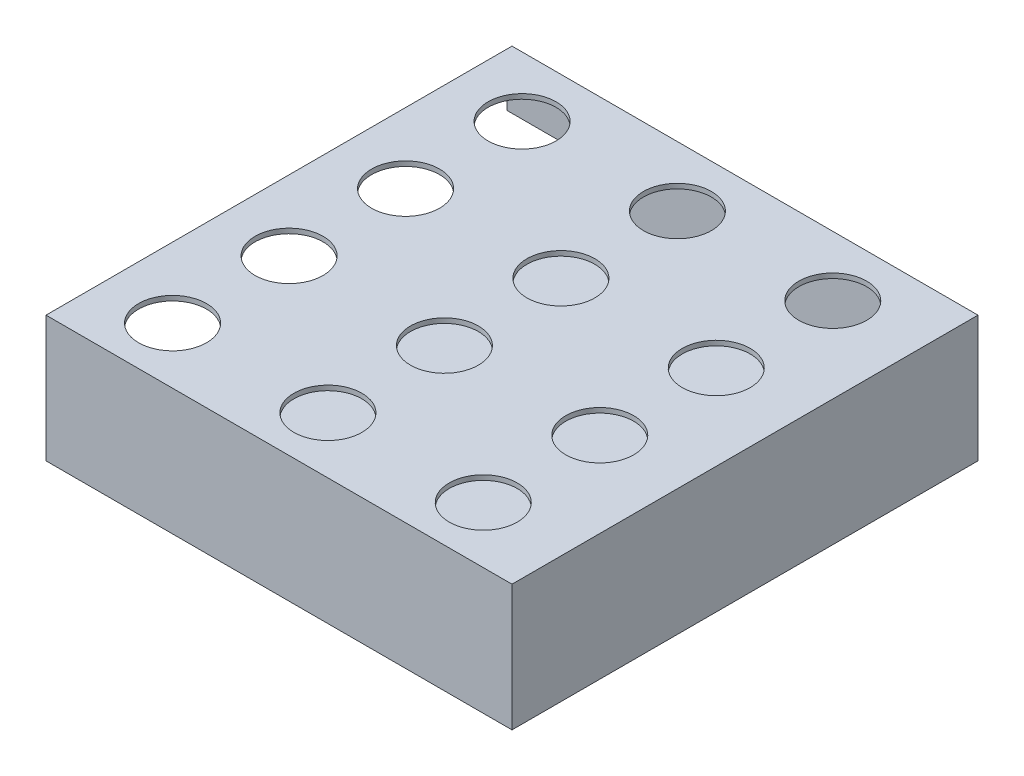
ISO-10303-21;
HEADER;
FILE_DESCRIPTION(('STEP AP214'),'2;1');
FILE_NAME('part.step','',(''),(''),'','','');
FILE_SCHEMA(('AUTOMOTIVE_DESIGN { 1 0 10303 214 1 1 1 1 }'));
ENDSEC;
DATA;
#1=APPLICATION_CONTEXT('core data for automotive mechanical design processes');
#2=APPLICATION_PROTOCOL_DEFINITION('international standard','automotive_design',2000,#1);
#3=PRODUCT_CONTEXT('',#1,'mechanical');
#4=PRODUCT('Part','Part','',(#3));
#5=PRODUCT_RELATED_PRODUCT_CATEGORY('part','',(#4));
#6=PRODUCT_DEFINITION_FORMATION('','',#4);
#7=PRODUCT_DEFINITION_CONTEXT('part definition',#1,'design');
#8=PRODUCT_DEFINITION('design','',#6,#7);
#9=PRODUCT_DEFINITION_SHAPE('','',#8);
#10=(LENGTH_UNIT() NAMED_UNIT(*) SI_UNIT(.MILLI.,.METRE.));
#11=(NAMED_UNIT(*) PLANE_ANGLE_UNIT() SI_UNIT($,.RADIAN.));
#12=(NAMED_UNIT(*) SI_UNIT($,.STERADIAN.) SOLID_ANGLE_UNIT());
#13=UNCERTAINTY_MEASURE_WITH_UNIT(LENGTH_MEASURE(1.E-05),#10,'distance_accuracy_value','');
#14=(GEOMETRIC_REPRESENTATION_CONTEXT(3) GLOBAL_UNCERTAINTY_ASSIGNED_CONTEXT((#13)) GLOBAL_UNIT_ASSIGNED_CONTEXT((#10,
#11,#12)) REPRESENTATION_CONTEXT('',''));
#15=CARTESIAN_POINT('',(0.,0.,0.));
#16=DIRECTION('',(0.,0.,1.));
#17=DIRECTION('',(1.,0.,0.));
#18=AXIS2_PLACEMENT_3D('',#15,#16,#17);
#19=CARTESIAN_POINT('',(-304.8,-82.55,-609.6));
#20=DIRECTION('',(-1.,0.,0.));
#21=DIRECTION('',(0.,0.,1.));
#22=AXIS2_PLACEMENT_3D('',#19,#20,#21);
#23=PLANE('',#22);
#24=DIRECTION('',(0.,0.,1.));
#25=VECTOR('',#24,1.);
#26=CARTESIAN_POINT('',(-304.8,-76.2,-609.6));
#27=LINE('',#26,#25);
#28=CARTESIAN_POINT('',(-304.8,-76.2,-609.6));
#29=VERTEX_POINT('',#28);
#30=CARTESIAN_POINT('',(-304.8,-76.2,-6.35));
#31=VERTEX_POINT('',#30);
#32=EDGE_CURVE('E317',#29,#31,#27,.T.);
#33=ORIENTED_EDGE('',*,*,#32,.F.);
#34=DIRECTION('',(0.,-1.,0.));
#35=VECTOR('',#34,1.);
#36=CARTESIAN_POINT('',(-304.8,-82.55,-609.6));
#37=LINE('',#36,#35);
#38=CARTESIAN_POINT('',(-304.8,-82.55,-609.6));
#39=VERTEX_POINT('',#38);
#40=EDGE_CURVE('E155',#29,#39,#37,.T.);
#41=ORIENTED_EDGE('',*,*,#40,.T.);
#42=DIRECTION('',(0.,0.,1.));
#43=VECTOR('',#42,1.);
#44=CARTESIAN_POINT('',(-304.8,-82.55,-609.6));
#45=LINE('',#44,#43);
#46=CARTESIAN_POINT('',(-304.8,-82.55,0.));
#47=VERTEX_POINT('',#46);
#48=EDGE_CURVE('E177',#39,#47,#45,.T.);
#49=ORIENTED_EDGE('',*,*,#48,.T.);
#50=DIRECTION('',(0.,-1.,0.));
#51=VECTOR('',#50,1.);
#52=CARTESIAN_POINT('',(-304.8,-82.55,0.));
#53=LINE('',#52,#51);
#54=CARTESIAN_POINT('',(-304.8,82.55,0.));
#55=VERTEX_POINT('',#54);
#56=EDGE_CURVE('E169',#55,#47,#53,.T.);
#57=ORIENTED_EDGE('',*,*,#56,.F.);
#58=DIRECTION('',(0.,0.,1.));
#59=VECTOR('',#58,1.);
#60=CARTESIAN_POINT('',(-304.8,82.55,-609.6));
#61=LINE('',#60,#59);
#62=CARTESIAN_POINT('',(-304.8,82.55,-609.6));
#63=VERTEX_POINT('',#62);
#64=EDGE_CURVE('E153',#63,#55,#61,.T.);
#65=ORIENTED_EDGE('',*,*,#64,.F.);
#66=CARTESIAN_POINT('',(-304.8,12.7,-609.6));
#67=VERTEX_POINT('',#66);
#68=EDGE_CURVE('E148',#63,#67,#37,.T.);
#69=ORIENTED_EDGE('',*,*,#68,.T.);
#70=DIRECTION('',(0.,0.,-1.));
#71=VECTOR('',#70,1.);
#72=CARTESIAN_POINT('',(-304.8,12.7,-601.98));
#73=LINE('',#72,#71);
#74=CARTESIAN_POINT('',(-304.8,12.7,-603.25));
#75=VERTEX_POINT('',#74);
#76=EDGE_CURVE('E132',#75,#67,#73,.T.);
#77=ORIENTED_EDGE('',*,*,#76,.F.);
#78=DIRECTION('',(0.,-1.,0.));
#79=VECTOR('',#78,1.);
#80=CARTESIAN_POINT('',(-304.8,-82.55,-603.25));
#81=LINE('',#80,#79);
#82=CARTESIAN_POINT('',(-304.8,76.2,-603.25));
#83=VERTEX_POINT('',#82);
#84=EDGE_CURVE('E222',#83,#75,#81,.T.);
#85=ORIENTED_EDGE('',*,*,#84,.F.);
#86=DIRECTION('',(0.,0.,1.));
#87=VECTOR('',#86,1.);
#88=CARTESIAN_POINT('',(-304.8,76.2,-609.6));
#89=LINE('',#88,#87);
#90=CARTESIAN_POINT('',(-304.8,76.2,-6.35));
#91=VERTEX_POINT('',#90);
#92=EDGE_CURVE('E234',#83,#91,#89,.T.);
#93=ORIENTED_EDGE('',*,*,#92,.T.);
#94=DIRECTION('',(0.,-1.,0.));
#95=VECTOR('',#94,1.);
#96=CARTESIAN_POINT('',(-304.8,-82.55,-6.34999999999997));
#97=LINE('',#96,#95);
#98=EDGE_CURVE('E322',#91,#31,#97,.T.);
#99=ORIENTED_EDGE('',*,*,#98,.T.);
#100=EDGE_LOOP('',(#33,#41,#49,#57,#65,#69,#77,#85,#93,#99));
#101=FACE_BOUND('',#100,.T.);
#102=ADVANCED_FACE('F42',(#101),#23,.T.);
#103=CARTESIAN_POINT('',(304.8,-82.55,-609.6));
#104=DIRECTION('',(1.,0.,0.));
#105=DIRECTION('',(0.,0.,-1.));
#106=AXIS2_PLACEMENT_3D('',#103,#104,#105);
#107=PLANE('',#106);
#108=DIRECTION('',(0.,1.,0.));
#109=VECTOR('',#108,1.);
#110=CARTESIAN_POINT('',(304.8,-82.55,0.));
#111=LINE('',#110,#109);
#112=CARTESIAN_POINT('',(304.8,-82.55,0.));
#113=VERTEX_POINT('',#112);
#114=CARTESIAN_POINT('',(304.8,82.55,0.));
#115=VERTEX_POINT('',#114);
#116=EDGE_CURVE('E162',#113,#115,#111,.T.);
#117=ORIENTED_EDGE('',*,*,#116,.F.);
#118=DIRECTION('',(0.,0.,1.));
#119=VECTOR('',#118,1.);
#120=CARTESIAN_POINT('',(304.8,-82.55,-609.6));
#121=LINE('',#120,#119);
#122=CARTESIAN_POINT('',(304.8,-82.55,-609.6));
#123=VERTEX_POINT('',#122);
#124=EDGE_CURVE('E66',#123,#113,#121,.T.);
#125=ORIENTED_EDGE('',*,*,#124,.F.);
#126=DIRECTION('',(0.,1.,0.));
#127=VECTOR('',#126,1.);
#128=CARTESIAN_POINT('',(304.8,-82.55,-609.6));
#129=LINE('',#128,#127);
#130=CARTESIAN_POINT('',(304.8,82.55,-609.6));
#131=VERTEX_POINT('',#130);
#132=EDGE_CURVE('E175',#123,#131,#129,.T.);
#133=ORIENTED_EDGE('',*,*,#132,.T.);
#134=DIRECTION('',(0.,0.,1.));
#135=VECTOR('',#134,1.);
#136=CARTESIAN_POINT('',(304.8,82.55,-609.6));
#137=LINE('',#136,#135);
#138=EDGE_CURVE('E92',#131,#115,#137,.T.);
#139=ORIENTED_EDGE('',*,*,#138,.T.);
#140=EDGE_LOOP('',(#117,#125,#133,#139));
#141=FACE_BOUND('',#140,.T.);
#142=ADVANCED_FACE('F44',(#141),#107,.T.);
#143=CARTESIAN_POINT('',(-304.8,-82.55,-609.6));
#144=DIRECTION('',(0.,-1.,0.));
#145=DIRECTION('',(0.,0.,-1.));
#146=AXIS2_PLACEMENT_3D('',#143,#144,#145);
#147=PLANE('',#146);
#148=DIRECTION('',(1.,0.,0.));
#149=VECTOR('',#148,1.);
#150=CARTESIAN_POINT('',(-304.8,-82.55,0.));
#151=LINE('',#150,#149);
#152=EDGE_CURVE('E172',#47,#113,#151,.T.);
#153=ORIENTED_EDGE('',*,*,#152,.F.);
#154=ORIENTED_EDGE('',*,*,#48,.F.);
#155=DIRECTION('',(1.,0.,0.));
#156=VECTOR('',#155,1.);
#157=CARTESIAN_POINT('',(-304.8,-82.55,-609.6));
#158=LINE('',#157,#156);
#159=EDGE_CURVE('E154',#39,#123,#158,.T.);
#160=ORIENTED_EDGE('',*,*,#159,.T.);
#161=ORIENTED_EDGE('',*,*,#124,.T.);
#162=EDGE_LOOP('',(#153,#154,#160,#161));
#163=FACE_BOUND('',#162,.T.);
#164=ADVANCED_FACE('F240',(#163),#147,.T.);
#165=CARTESIAN_POINT('',(-304.8,82.55,-609.6));
#166=DIRECTION('',(0.,1.,0.));
#167=DIRECTION('',(0.,0.,1.));
#168=AXIS2_PLACEMENT_3D('',#165,#166,#167);
#169=PLANE('',#168);
#170=CARTESIAN_POINT('',(-9.74145652135042,82.55,-378.528168367074));
#171=DIRECTION('',(0.,1.,0.));
#172=DIRECTION('',(0.,0.,1.));
#173=AXIS2_PLACEMENT_3D('',#170,#171,#172);
#174=CIRCLE('',#173,44.45);
#175=CARTESIAN_POINT('',(-9.74145652135042,82.55,-334.078168367074));
#176=VERTEX_POINT('',#175);
#177=EDGE_CURVE('E264',#176,#176,#174,.T.);
#178=ORIENTED_EDGE('',*,*,#177,.F.);
#179=EDGE_LOOP('',(#178));
#180=FACE_BOUND('',#179,.T.);
#181=CARTESIAN_POINT('',(-9.74145652135042,82.55,-226.128168367074));
#182=DIRECTION('',(0.,1.,0.));
#183=DIRECTION('',(0.,0.,1.));
#184=AXIS2_PLACEMENT_3D('',#181,#182,#183);
#185=CIRCLE('',#184,44.45);
#186=CARTESIAN_POINT('',(-9.74145652135042,82.55,-181.678168367074));
#187=VERTEX_POINT('',#186);
#188=EDGE_CURVE('E268',#187,#187,#185,.T.);
#189=ORIENTED_EDGE('',*,*,#188,.F.);
#190=EDGE_LOOP('',(#189));
#191=FACE_BOUND('',#190,.T.);
#192=CARTESIAN_POINT('',(-212.94145652135,82.55,-226.128168367074));
#193=DIRECTION('',(0.,1.,0.));
#194=DIRECTION('',(0.,0.,1.));
#195=AXIS2_PLACEMENT_3D('',#192,#193,#194);
#196=CIRCLE('',#195,44.45);
#197=CARTESIAN_POINT('',(-212.94145652135,82.55,-181.678168367074));
#198=VERTEX_POINT('',#197);
#199=EDGE_CURVE('E272',#198,#198,#196,.T.);
#200=ORIENTED_EDGE('',*,*,#199,.F.);
#201=EDGE_LOOP('',(#200));
#202=FACE_BOUND('',#201,.T.);
#203=CARTESIAN_POINT('',(-9.74145652135044,82.55,-73.7281683670738));
#204=DIRECTION('',(0.,1.,0.));
#205=DIRECTION('',(0.,0.,1.));
#206=AXIS2_PLACEMENT_3D('',#203,#204,#205);
#207=CIRCLE('',#206,44.45);
#208=CARTESIAN_POINT('',(-9.74145652135044,82.55,-29.2781683670738));
#209=VERTEX_POINT('',#208);
#210=EDGE_CURVE('E276',#209,#209,#207,.T.);
#211=ORIENTED_EDGE('',*,*,#210,.F.);
#212=EDGE_LOOP('',(#211));
#213=FACE_BOUND('',#212,.T.);
#214=CARTESIAN_POINT('',(-212.94145652135,82.55,-378.528168367074));
#215=DIRECTION('',(0.,1.,0.));
#216=DIRECTION('',(0.,0.,1.));
#217=AXIS2_PLACEMENT_3D('',#214,#215,#216);
#218=CIRCLE('',#217,44.45);
#219=CARTESIAN_POINT('',(-212.94145652135,82.55,-334.078168367074));
#220=VERTEX_POINT('',#219);
#221=EDGE_CURVE('E280',#220,#220,#218,.T.);
#222=ORIENTED_EDGE('',*,*,#221,.F.);
#223=EDGE_LOOP('',(#222));
#224=FACE_BOUND('',#223,.T.);
#225=CARTESIAN_POINT('',(-212.94145652135,82.55,-73.7281683670738));
#226=DIRECTION('',(0.,1.,0.));
#227=DIRECTION('',(0.,0.,1.));
#228=AXIS2_PLACEMENT_3D('',#225,#226,#227);
#229=CIRCLE('',#228,44.45);
#230=CARTESIAN_POINT('',(-212.94145652135,82.55,-29.2781683670738));
#231=VERTEX_POINT('',#230);
#232=EDGE_CURVE('E284',#231,#231,#229,.T.);
#233=ORIENTED_EDGE('',*,*,#232,.F.);
#234=EDGE_LOOP('',(#233));
#235=FACE_BOUND('',#234,.T.);
#236=CARTESIAN_POINT('',(193.45854347865,82.55,-530.928168367074));
#237=DIRECTION('',(0.,1.,0.));
#238=DIRECTION('',(0.,0.,1.));
#239=AXIS2_PLACEMENT_3D('',#236,#237,#238);
#240=CIRCLE('',#239,44.45);
#241=CARTESIAN_POINT('',(193.45854347865,82.55,-486.478168367074));
#242=VERTEX_POINT('',#241);
#243=EDGE_CURVE('E288',#242,#242,#240,.T.);
#244=ORIENTED_EDGE('',*,*,#243,.F.);
#245=EDGE_LOOP('',(#244));
#246=FACE_BOUND('',#245,.T.);
#247=CARTESIAN_POINT('',(-9.74145652135041,82.55,-530.928168367074));
#248=DIRECTION('',(0.,1.,0.));
#249=DIRECTION('',(0.,0.,1.));
#250=AXIS2_PLACEMENT_3D('',#247,#248,#249);
#251=CIRCLE('',#250,44.45);
#252=CARTESIAN_POINT('',(-9.74145652135041,82.55,-486.478168367074));
#253=VERTEX_POINT('',#252);
#254=EDGE_CURVE('E292',#253,#253,#251,.T.);
#255=ORIENTED_EDGE('',*,*,#254,.F.);
#256=EDGE_LOOP('',(#255));
#257=FACE_BOUND('',#256,.T.);
#258=CARTESIAN_POINT('',(193.45854347865,82.55,-73.7281683670738));
#259=DIRECTION('',(0.,1.,0.));
#260=DIRECTION('',(0.,0.,1.));
#261=AXIS2_PLACEMENT_3D('',#258,#259,#260);
#262=CIRCLE('',#261,44.45);
#263=CARTESIAN_POINT('',(193.45854347865,82.55,-29.2781683670738));
#264=VERTEX_POINT('',#263);
#265=EDGE_CURVE('E296',#264,#264,#262,.T.);
#266=ORIENTED_EDGE('',*,*,#265,.F.);
#267=EDGE_LOOP('',(#266));
#268=FACE_BOUND('',#267,.T.);
#269=CARTESIAN_POINT('',(193.45854347865,82.55,-226.128168367074));
#270=DIRECTION('',(0.,1.,0.));
#271=DIRECTION('',(0.,0.,1.));
#272=AXIS2_PLACEMENT_3D('',#269,#270,#271);
#273=CIRCLE('',#272,44.45);
#274=CARTESIAN_POINT('',(193.45854347865,82.55,-181.678168367074));
#275=VERTEX_POINT('',#274);
#276=EDGE_CURVE('E300',#275,#275,#273,.T.);
#277=ORIENTED_EDGE('',*,*,#276,.F.);
#278=EDGE_LOOP('',(#277));
#279=FACE_BOUND('',#278,.T.);
#280=CARTESIAN_POINT('',(193.45854347865,82.55,-378.528168367074));
#281=DIRECTION('',(0.,1.,0.));
#282=DIRECTION('',(0.,0.,1.));
#283=AXIS2_PLACEMENT_3D('',#280,#281,#282);
#284=CIRCLE('',#283,44.45);
#285=CARTESIAN_POINT('',(193.45854347865,82.55,-334.078168367074));
#286=VERTEX_POINT('',#285);
#287=EDGE_CURVE('E304',#286,#286,#284,.T.);
#288=ORIENTED_EDGE('',*,*,#287,.F.);
#289=EDGE_LOOP('',(#288));
#290=FACE_BOUND('',#289,.T.);
#291=CARTESIAN_POINT('',(-212.94145652135,82.55,-530.928168367074));
#292=DIRECTION('',(0.,1.,0.));
#293=DIRECTION('',(0.,0.,1.));
#294=AXIS2_PLACEMENT_3D('',#291,#292,#293);
#295=CIRCLE('',#294,44.45);
#296=CARTESIAN_POINT('',(-212.94145652135,82.55,-486.478168367074));
#297=VERTEX_POINT('',#296);
#298=EDGE_CURVE('E185',#297,#297,#295,.T.);
#299=ORIENTED_EDGE('',*,*,#298,.F.);
#300=EDGE_LOOP('',(#299));
#301=FACE_BOUND('',#300,.T.);
#302=DIRECTION('',(-1.,0.,0.));
#303=VECTOR('',#302,1.);
#304=CARTESIAN_POINT('',(-304.8,82.55,0.));
#305=LINE('',#304,#303);
#306=EDGE_CURVE('E165',#115,#55,#305,.T.);
#307=ORIENTED_EDGE('',*,*,#306,.F.);
#308=ORIENTED_EDGE('',*,*,#138,.F.);
#309=DIRECTION('',(-1.,0.,0.));
#310=VECTOR('',#309,1.);
#311=CARTESIAN_POINT('',(-304.8,82.55,-609.6));
#312=LINE('',#311,#310);
#313=EDGE_CURVE('E158',#131,#63,#312,.T.);
#314=ORIENTED_EDGE('',*,*,#313,.T.);
#315=ORIENTED_EDGE('',*,*,#64,.T.);
#316=EDGE_LOOP('',(#307,#308,#314,#315));
#317=FACE_BOUND('',#316,.T.);
#318=ADVANCED_FACE('F236',(#180,#191,#202,#213,#224,#235,#246,#257,#268,#279,#290,#301,#317),
#169,.T.);
#319=CARTESIAN_POINT('',(0.,0.,-609.6));
#320=DIRECTION('',(0.,0.,-1.));
#321=DIRECTION('',(-1.,0.,0.));
#322=AXIS2_PLACEMENT_3D('',#319,#320,#321);
#323=PLANE('',#322);
#324=DIRECTION('',(-1.,0.,0.));
#325=VECTOR('',#324,1.);
#326=CARTESIAN_POINT('',(-304.8,-76.2,-609.6));
#327=LINE('',#326,#325);
#328=CARTESIAN_POINT('',(-215.9,-76.2,-609.6));
#329=VERTEX_POINT('',#328);
#330=EDGE_CURVE('E142',#329,#29,#327,.T.);
#331=ORIENTED_EDGE('',*,*,#330,.F.);
#332=DIRECTION('',(0.,-1.,0.));
#333=VECTOR('',#332,1.);
#334=CARTESIAN_POINT('',(-215.9,-76.2,-609.6));
#335=LINE('',#334,#333);
#336=CARTESIAN_POINT('',(-215.9,12.7,-609.6));
#337=VERTEX_POINT('',#336);
#338=EDGE_CURVE('E150',#337,#329,#335,.T.);
#339=ORIENTED_EDGE('',*,*,#338,.F.);
#340=DIRECTION('',(1.,0.,0.));
#341=VECTOR('',#340,1.);
#342=CARTESIAN_POINT('',(-304.8,12.7,-609.6));
#343=LINE('',#342,#341);
#344=EDGE_CURVE('E135',#67,#337,#343,.T.);
#345=ORIENTED_EDGE('',*,*,#344,.F.);
#346=ORIENTED_EDGE('',*,*,#68,.F.);
#347=ORIENTED_EDGE('',*,*,#313,.F.);
#348=ORIENTED_EDGE('',*,*,#132,.F.);
#349=ORIENTED_EDGE('',*,*,#159,.F.);
#350=ORIENTED_EDGE('',*,*,#40,.F.);
#351=EDGE_LOOP('',(#331,#339,#345,#346,#347,#348,#349,#350));
#352=FACE_BOUND('',#351,.T.);
#353=ADVANCED_FACE('F147',(#352),#323,.T.);
#354=CARTESIAN_POINT('',(0.,0.,0.));
#355=DIRECTION('',(0.,0.,-1.));
#356=DIRECTION('',(-1.,0.,0.));
#357=AXIS2_PLACEMENT_3D('',#354,#355,#356);
#358=PLANE('',#357);
#359=ORIENTED_EDGE('',*,*,#116,.T.);
#360=ORIENTED_EDGE('',*,*,#306,.T.);
#361=ORIENTED_EDGE('',*,*,#56,.T.);
#362=ORIENTED_EDGE('',*,*,#152,.T.);
#363=EDGE_LOOP('',(#359,#360,#361,#362));
#364=FACE_BOUND('',#363,.T.);
#365=ADVANCED_FACE('F242',(#364),#358,.F.);
#366=CARTESIAN_POINT('',(298.45,-82.55,-609.6));
#367=DIRECTION('',(1.,0.,0.));
#368=DIRECTION('',(0.,0.,-1.));
#369=AXIS2_PLACEMENT_3D('',#366,#367,#368);
#370=PLANE('',#369);
#371=DIRECTION('',(0.,1.,0.));
#372=VECTOR('',#371,1.);
#373=CARTESIAN_POINT('',(298.45,-82.55,-6.34999999999997));
#374=LINE('',#373,#372);
#375=CARTESIAN_POINT('',(298.45,-76.2,-6.35));
#376=VERTEX_POINT('',#375);
#377=CARTESIAN_POINT('',(298.45,76.2,-6.35));
#378=VERTEX_POINT('',#377);
#379=EDGE_CURVE('E217',#376,#378,#374,.T.);
#380=ORIENTED_EDGE('',*,*,#379,.T.);
#381=DIRECTION('',(0.,0.,1.));
#382=VECTOR('',#381,1.);
#383=CARTESIAN_POINT('',(298.45,76.2,-609.6));
#384=LINE('',#383,#382);
#385=CARTESIAN_POINT('',(298.45,76.2,-603.25));
#386=VERTEX_POINT('',#385);
#387=EDGE_CURVE('E229',#386,#378,#384,.T.);
#388=ORIENTED_EDGE('',*,*,#387,.F.);
#389=DIRECTION('',(0.,1.,0.));
#390=VECTOR('',#389,1.);
#391=CARTESIAN_POINT('',(298.45,-82.55,-603.25));
#392=LINE('',#391,#390);
#393=CARTESIAN_POINT('',(298.45,-76.2,-603.25));
#394=VERTEX_POINT('',#393);
#395=EDGE_CURVE('E231',#394,#386,#392,.T.);
#396=ORIENTED_EDGE('',*,*,#395,.F.);
#397=DIRECTION('',(0.,0.,1.));
#398=VECTOR('',#397,1.);
#399=CARTESIAN_POINT('',(298.45,-76.2,-609.6));
#400=LINE('',#399,#398);
#401=EDGE_CURVE('E166',#394,#376,#400,.T.);
#402=ORIENTED_EDGE('',*,*,#401,.T.);
#403=EDGE_LOOP('',(#380,#388,#396,#402));
#404=FACE_BOUND('',#403,.T.);
#405=ADVANCED_FACE('F337',(#404),#370,.F.);
#406=CARTESIAN_POINT('',(-304.8,-76.2,-609.6));
#407=DIRECTION('',(0.,-1.,0.));
#408=DIRECTION('',(0.,0.,-1.));
#409=AXIS2_PLACEMENT_3D('',#406,#407,#408);
#410=PLANE('',#409);
#411=DIRECTION('',(1.,0.,0.));
#412=VECTOR('',#411,1.);
#413=CARTESIAN_POINT('',(-304.8,-76.2,-603.25));
#414=LINE('',#413,#412);
#415=CARTESIAN_POINT('',(-215.9,-76.2,-603.25));
#416=VERTEX_POINT('',#415);
#417=EDGE_CURVE('E227',#416,#394,#414,.T.);
#418=ORIENTED_EDGE('',*,*,#417,.F.);
#419=DIRECTION('',(0.,0.,-1.));
#420=VECTOR('',#419,1.);
#421=CARTESIAN_POINT('',(-215.9,-76.2,-601.98));
#422=LINE('',#421,#420);
#423=EDGE_CURVE('E341',#416,#329,#422,.T.);
#424=ORIENTED_EDGE('',*,*,#423,.T.);
#425=ORIENTED_EDGE('',*,*,#330,.T.);
#426=ORIENTED_EDGE('',*,*,#32,.T.);
#427=DIRECTION('',(1.,0.,0.));
#428=VECTOR('',#427,1.);
#429=CARTESIAN_POINT('',(-304.8,-76.2,-6.34999999999997));
#430=LINE('',#429,#428);
#431=EDGE_CURVE('E319',#31,#376,#430,.T.);
#432=ORIENTED_EDGE('',*,*,#431,.T.);
#433=ORIENTED_EDGE('',*,*,#401,.F.);
#434=EDGE_LOOP('',(#418,#424,#425,#426,#432,#433));
#435=FACE_BOUND('',#434,.T.);
#436=ADVANCED_FACE('F340',(#435),#410,.F.);
#437=CARTESIAN_POINT('',(-304.8,76.2,-609.6));
#438=DIRECTION('',(0.,1.,0.));
#439=DIRECTION('',(0.,0.,1.));
#440=AXIS2_PLACEMENT_3D('',#437,#438,#439);
#441=PLANE('',#440);
#442=CARTESIAN_POINT('',(-9.74145652135042,76.2,-378.528168367074));
#443=DIRECTION('',(0.,1.,0.));
#444=DIRECTION('',(0.,0.,1.));
#445=AXIS2_PLACEMENT_3D('',#442,#443,#444);
#446=CIRCLE('',#445,44.45);
#447=CARTESIAN_POINT('',(-9.74145652135042,76.2,-334.078168367074));
#448=VERTEX_POINT('',#447);
#449=EDGE_CURVE('E215',#448,#448,#446,.T.);
#450=ORIENTED_EDGE('',*,*,#449,.T.);
#451=EDGE_LOOP('',(#450));
#452=FACE_BOUND('',#451,.T.);
#453=CARTESIAN_POINT('',(-9.74145652135042,76.2,-226.128168367074));
#454=DIRECTION('',(0.,1.,0.));
#455=DIRECTION('',(0.,0.,1.));
#456=AXIS2_PLACEMENT_3D('',#453,#454,#455);
#457=CIRCLE('',#456,44.45);
#458=CARTESIAN_POINT('',(-9.74145652135042,76.2,-181.678168367074));
#459=VERTEX_POINT('',#458);
#460=EDGE_CURVE('E212',#459,#459,#457,.T.);
#461=ORIENTED_EDGE('',*,*,#460,.T.);
#462=EDGE_LOOP('',(#461));
#463=FACE_BOUND('',#462,.T.);
#464=CARTESIAN_POINT('',(-212.94145652135,76.2,-226.128168367074));
#465=DIRECTION('',(0.,1.,0.));
#466=DIRECTION('',(0.,0.,1.));
#467=AXIS2_PLACEMENT_3D('',#464,#465,#466);
#468=CIRCLE('',#467,44.45);
#469=CARTESIAN_POINT('',(-212.94145652135,76.2,-181.678168367074));
#470=VERTEX_POINT('',#469);
#471=EDGE_CURVE('E209',#470,#470,#468,.T.);
#472=ORIENTED_EDGE('',*,*,#471,.T.);
#473=EDGE_LOOP('',(#472));
#474=FACE_BOUND('',#473,.T.);
#475=CARTESIAN_POINT('',(-9.74145652135044,76.2,-73.7281683670738));
#476=DIRECTION('',(0.,1.,0.));
#477=DIRECTION('',(0.,0.,1.));
#478=AXIS2_PLACEMENT_3D('',#475,#476,#477);
#479=CIRCLE('',#478,44.45);
#480=CARTESIAN_POINT('',(-9.74145652135044,76.2,-29.2781683670738));
#481=VERTEX_POINT('',#480);
#482=EDGE_CURVE('E206',#481,#481,#479,.T.);
#483=ORIENTED_EDGE('',*,*,#482,.T.);
#484=EDGE_LOOP('',(#483));
#485=FACE_BOUND('',#484,.T.);
#486=CARTESIAN_POINT('',(-212.94145652135,76.2,-378.528168367074));
#487=DIRECTION('',(0.,1.,0.));
#488=DIRECTION('',(0.,0.,1.));
#489=AXIS2_PLACEMENT_3D('',#486,#487,#488);
#490=CIRCLE('',#489,44.45);
#491=CARTESIAN_POINT('',(-212.94145652135,76.2,-334.078168367074));
#492=VERTEX_POINT('',#491);
#493=EDGE_CURVE('E203',#492,#492,#490,.T.);
#494=ORIENTED_EDGE('',*,*,#493,.T.);
#495=EDGE_LOOP('',(#494));
#496=FACE_BOUND('',#495,.T.);
#497=CARTESIAN_POINT('',(-212.94145652135,76.2,-73.7281683670738));
#498=DIRECTION('',(0.,1.,0.));
#499=DIRECTION('',(0.,0.,1.));
#500=AXIS2_PLACEMENT_3D('',#497,#498,#499);
#501=CIRCLE('',#500,44.45);
#502=CARTESIAN_POINT('',(-212.94145652135,76.2,-29.2781683670738));
#503=VERTEX_POINT('',#502);
#504=EDGE_CURVE('E200',#503,#503,#501,.T.);
#505=ORIENTED_EDGE('',*,*,#504,.T.);
#506=EDGE_LOOP('',(#505));
#507=FACE_BOUND('',#506,.T.);
#508=CARTESIAN_POINT('',(193.45854347865,76.2,-530.928168367074));
#509=DIRECTION('',(0.,1.,0.));
#510=DIRECTION('',(0.,0.,1.));
#511=AXIS2_PLACEMENT_3D('',#508,#509,#510);
#512=CIRCLE('',#511,44.45);
#513=CARTESIAN_POINT('',(193.45854347865,76.2,-486.478168367074));
#514=VERTEX_POINT('',#513);
#515=EDGE_CURVE('E197',#514,#514,#512,.T.);
#516=ORIENTED_EDGE('',*,*,#515,.T.);
#517=EDGE_LOOP('',(#516));
#518=FACE_BOUND('',#517,.T.);
#519=CARTESIAN_POINT('',(-9.74145652135041,76.2,-530.928168367074));
#520=DIRECTION('',(0.,1.,0.));
#521=DIRECTION('',(0.,0.,1.));
#522=AXIS2_PLACEMENT_3D('',#519,#520,#521);
#523=CIRCLE('',#522,44.45);
#524=CARTESIAN_POINT('',(-9.74145652135041,76.2,-486.478168367074));
#525=VERTEX_POINT('',#524);
#526=EDGE_CURVE('E194',#525,#525,#523,.T.);
#527=ORIENTED_EDGE('',*,*,#526,.T.);
#528=EDGE_LOOP('',(#527));
#529=FACE_BOUND('',#528,.T.);
#530=CARTESIAN_POINT('',(193.45854347865,76.2,-73.7281683670738));
#531=DIRECTION('',(0.,1.,0.));
#532=DIRECTION('',(0.,0.,1.));
#533=AXIS2_PLACEMENT_3D('',#530,#531,#532);
#534=CIRCLE('',#533,44.45);
#535=CARTESIAN_POINT('',(193.45854347865,76.2,-29.2781683670738));
#536=VERTEX_POINT('',#535);
#537=EDGE_CURVE('E191',#536,#536,#534,.T.);
#538=ORIENTED_EDGE('',*,*,#537,.T.);
#539=EDGE_LOOP('',(#538));
#540=FACE_BOUND('',#539,.T.);
#541=CARTESIAN_POINT('',(193.45854347865,76.2,-226.128168367074));
#542=DIRECTION('',(0.,1.,0.));
#543=DIRECTION('',(0.,0.,1.));
#544=AXIS2_PLACEMENT_3D('',#541,#542,#543);
#545=CIRCLE('',#544,44.45);
#546=CARTESIAN_POINT('',(193.45854347865,76.2,-181.678168367074));
#547=VERTEX_POINT('',#546);
#548=EDGE_CURVE('E188',#547,#547,#545,.T.);
#549=ORIENTED_EDGE('',*,*,#548,.T.);
#550=EDGE_LOOP('',(#549));
#551=FACE_BOUND('',#550,.T.);
#552=CARTESIAN_POINT('',(193.45854347865,76.2,-378.528168367074));
#553=DIRECTION('',(0.,1.,0.));
#554=DIRECTION('',(0.,0.,1.));
#555=AXIS2_PLACEMENT_3D('',#552,#553,#554);
#556=CIRCLE('',#555,44.45);
#557=CARTESIAN_POINT('',(193.45854347865,76.2,-334.078168367074));
#558=VERTEX_POINT('',#557);
#559=EDGE_CURVE('E184',#558,#558,#556,.T.);
#560=ORIENTED_EDGE('',*,*,#559,.T.);
#561=EDGE_LOOP('',(#560));
#562=FACE_BOUND('',#561,.T.);
#563=CARTESIAN_POINT('',(-212.94145652135,76.2,-530.928168367074));
#564=DIRECTION('',(0.,1.,0.));
#565=DIRECTION('',(0.,0.,1.));
#566=AXIS2_PLACEMENT_3D('',#563,#564,#565);
#567=CIRCLE('',#566,44.45);
#568=CARTESIAN_POINT('',(-212.94145652135,76.2,-486.478168367074));
#569=VERTEX_POINT('',#568);
#570=EDGE_CURVE('E181',#569,#569,#567,.T.);
#571=ORIENTED_EDGE('',*,*,#570,.T.);
#572=EDGE_LOOP('',(#571));
#573=FACE_BOUND('',#572,.T.);
#574=DIRECTION('',(-1.,0.,0.));
#575=VECTOR('',#574,1.);
#576=CARTESIAN_POINT('',(-304.8,76.2,-6.34999999999997));
#577=LINE('',#576,#575);
#578=EDGE_CURVE('E315',#378,#91,#577,.T.);
#579=ORIENTED_EDGE('',*,*,#578,.T.);
#580=ORIENTED_EDGE('',*,*,#92,.F.);
#581=DIRECTION('',(-1.,0.,0.));
#582=VECTOR('',#581,1.);
#583=CARTESIAN_POINT('',(-304.8,76.2,-603.25));
#584=LINE('',#583,#582);
#585=EDGE_CURVE('E225',#386,#83,#584,.T.);
#586=ORIENTED_EDGE('',*,*,#585,.F.);
#587=ORIENTED_EDGE('',*,*,#387,.T.);
#588=EDGE_LOOP('',(#579,#580,#586,#587));
#589=FACE_BOUND('',#588,.T.);
#590=ADVANCED_FACE('F334',(#452,#463,#474,#485,#496,#507,#518,#529,#540,#551,#562,#573,#589),
#441,.F.);
#591=CARTESIAN_POINT('',(0.,0.,-603.25));
#592=DIRECTION('',(0.,0.,-1.));
#593=DIRECTION('',(-1.,0.,0.));
#594=AXIS2_PLACEMENT_3D('',#591,#592,#593);
#595=PLANE('',#594);
#596=DIRECTION('',(1.,0.,0.));
#597=VECTOR('',#596,1.);
#598=CARTESIAN_POINT('',(0.,12.7,-603.25));
#599=LINE('',#598,#597);
#600=CARTESIAN_POINT('',(-215.9,12.7,-603.25));
#601=VERTEX_POINT('',#600);
#602=EDGE_CURVE('E50',#75,#601,#599,.T.);
#603=ORIENTED_EDGE('',*,*,#602,.T.);
#604=DIRECTION('',(0.,-1.,0.));
#605=VECTOR('',#604,1.);
#606=CARTESIAN_POINT('',(-215.9,0.,-603.25));
#607=LINE('',#606,#605);
#608=EDGE_CURVE('E11',#601,#416,#607,.T.);
#609=ORIENTED_EDGE('',*,*,#608,.T.);
#610=ORIENTED_EDGE('',*,*,#417,.T.);
#611=ORIENTED_EDGE('',*,*,#395,.T.);
#612=ORIENTED_EDGE('',*,*,#585,.T.);
#613=ORIENTED_EDGE('',*,*,#84,.T.);
#614=EDGE_LOOP('',(#603,#609,#610,#611,#612,#613));
#615=FACE_BOUND('',#614,.T.);
#616=ADVANCED_FACE('F219',(#615),#595,.F.);
#617=CARTESIAN_POINT('',(0.,0.,-6.35));
#618=DIRECTION('',(0.,0.,-1.));
#619=DIRECTION('',(-1.,0.,0.));
#620=AXIS2_PLACEMENT_3D('',#617,#618,#619);
#621=PLANE('',#620);
#622=ORIENTED_EDGE('',*,*,#379,.F.);
#623=ORIENTED_EDGE('',*,*,#431,.F.);
#624=ORIENTED_EDGE('',*,*,#98,.F.);
#625=ORIENTED_EDGE('',*,*,#578,.F.);
#626=EDGE_LOOP('',(#622,#623,#624,#625));
#627=FACE_BOUND('',#626,.T.);
#628=ADVANCED_FACE('F332',(#627),#621,.T.);
#629=CARTESIAN_POINT('',(-212.94145652135,74.93,-530.928168367074));
#630=DIRECTION('',(0.,1.,0.));
#631=DIRECTION('',(0.,0.,1.));
#632=AXIS2_PLACEMENT_3D('',#629,#630,#631);
#633=CYLINDRICAL_SURFACE('',#632,44.45);
#634=ORIENTED_EDGE('',*,*,#298,.T.);
#635=EDGE_LOOP('',(#634));
#636=FACE_BOUND('',#635,.T.);
#637=ORIENTED_EDGE('',*,*,#570,.F.);
#638=EDGE_LOOP('',(#637));
#639=FACE_BOUND('',#638,.T.);
#640=ADVANCED_FACE('F382',(#636,#639),#633,.F.);
#641=CARTESIAN_POINT('',(193.45854347865,74.93,-378.528168367074));
#642=DIRECTION('',(0.,1.,0.));
#643=DIRECTION('',(0.,0.,1.));
#644=AXIS2_PLACEMENT_3D('',#641,#642,#643);
#645=CYLINDRICAL_SURFACE('',#644,44.45);
#646=ORIENTED_EDGE('',*,*,#287,.T.);
#647=EDGE_LOOP('',(#646));
#648=FACE_BOUND('',#647,.T.);
#649=ORIENTED_EDGE('',*,*,#559,.F.);
#650=EDGE_LOOP('',(#649));
#651=FACE_BOUND('',#650,.T.);
#652=ADVANCED_FACE('F384',(#648,#651),#645,.F.);
#653=CARTESIAN_POINT('',(193.45854347865,74.93,-226.128168367074));
#654=DIRECTION('',(0.,1.,0.));
#655=DIRECTION('',(0.,0.,1.));
#656=AXIS2_PLACEMENT_3D('',#653,#654,#655);
#657=CYLINDRICAL_SURFACE('',#656,44.45);
#658=ORIENTED_EDGE('',*,*,#276,.T.);
#659=EDGE_LOOP('',(#658));
#660=FACE_BOUND('',#659,.T.);
#661=ORIENTED_EDGE('',*,*,#548,.F.);
#662=EDGE_LOOP('',(#661));
#663=FACE_BOUND('',#662,.T.);
#664=ADVANCED_FACE('F390',(#660,#663),#657,.F.);
#665=CARTESIAN_POINT('',(193.45854347865,74.93,-73.7281683670738));
#666=DIRECTION('',(0.,1.,0.));
#667=DIRECTION('',(0.,0.,1.));
#668=AXIS2_PLACEMENT_3D('',#665,#666,#667);
#669=CYLINDRICAL_SURFACE('',#668,44.45);
#670=ORIENTED_EDGE('',*,*,#265,.T.);
#671=EDGE_LOOP('',(#670));
#672=FACE_BOUND('',#671,.T.);
#673=ORIENTED_EDGE('',*,*,#537,.F.);
#674=EDGE_LOOP('',(#673));
#675=FACE_BOUND('',#674,.T.);
#676=ADVANCED_FACE('F493',(#672,#675),#669,.F.);
#677=CARTESIAN_POINT('',(-9.74145652135041,74.93,-530.928168367074));
#678=DIRECTION('',(0.,1.,0.));
#679=DIRECTION('',(0.,0.,1.));
#680=AXIS2_PLACEMENT_3D('',#677,#678,#679);
#681=CYLINDRICAL_SURFACE('',#680,44.45);
#682=ORIENTED_EDGE('',*,*,#254,.T.);
#683=EDGE_LOOP('',(#682));
#684=FACE_BOUND('',#683,.T.);
#685=ORIENTED_EDGE('',*,*,#526,.F.);
#686=EDGE_LOOP('',(#685));
#687=FACE_BOUND('',#686,.T.);
#688=ADVANCED_FACE('F503',(#684,#687),#681,.F.);
#689=CARTESIAN_POINT('',(193.45854347865,74.93,-530.928168367074));
#690=DIRECTION('',(0.,1.,0.));
#691=DIRECTION('',(0.,0.,1.));
#692=AXIS2_PLACEMENT_3D('',#689,#690,#691);
#693=CYLINDRICAL_SURFACE('',#692,44.45);
#694=ORIENTED_EDGE('',*,*,#243,.T.);
#695=EDGE_LOOP('',(#694));
#696=FACE_BOUND('',#695,.T.);
#697=ORIENTED_EDGE('',*,*,#515,.F.);
#698=EDGE_LOOP('',(#697));
#699=FACE_BOUND('',#698,.T.);
#700=ADVANCED_FACE('F513',(#696,#699),#693,.F.);
#701=CARTESIAN_POINT('',(-212.94145652135,74.93,-73.7281683670738));
#702=DIRECTION('',(0.,1.,0.));
#703=DIRECTION('',(0.,0.,1.));
#704=AXIS2_PLACEMENT_3D('',#701,#702,#703);
#705=CYLINDRICAL_SURFACE('',#704,44.45);
#706=ORIENTED_EDGE('',*,*,#232,.T.);
#707=EDGE_LOOP('',(#706));
#708=FACE_BOUND('',#707,.T.);
#709=ORIENTED_EDGE('',*,*,#504,.F.);
#710=EDGE_LOOP('',(#709));
#711=FACE_BOUND('',#710,.T.);
#712=ADVANCED_FACE('F360',(#708,#711),#705,.F.);
#713=CARTESIAN_POINT('',(-212.94145652135,74.93,-378.528168367074));
#714=DIRECTION('',(0.,1.,0.));
#715=DIRECTION('',(0.,0.,1.));
#716=AXIS2_PLACEMENT_3D('',#713,#714,#715);
#717=CYLINDRICAL_SURFACE('',#716,44.45);
#718=ORIENTED_EDGE('',*,*,#221,.T.);
#719=EDGE_LOOP('',(#718));
#720=FACE_BOUND('',#719,.T.);
#721=ORIENTED_EDGE('',*,*,#493,.F.);
#722=EDGE_LOOP('',(#721));
#723=FACE_BOUND('',#722,.T.);
#724=ADVANCED_FACE('F356',(#720,#723),#717,.F.);
#725=CARTESIAN_POINT('',(-9.74145652135044,74.93,-73.7281683670738));
#726=DIRECTION('',(0.,1.,0.));
#727=DIRECTION('',(0.,0.,1.));
#728=AXIS2_PLACEMENT_3D('',#725,#726,#727);
#729=CYLINDRICAL_SURFACE('',#728,44.45);
#730=ORIENTED_EDGE('',*,*,#210,.T.);
#731=EDGE_LOOP('',(#730));
#732=FACE_BOUND('',#731,.T.);
#733=ORIENTED_EDGE('',*,*,#482,.F.);
#734=EDGE_LOOP('',(#733));
#735=FACE_BOUND('',#734,.T.);
#736=ADVANCED_FACE('F359',(#732,#735),#729,.F.);
#737=CARTESIAN_POINT('',(-212.94145652135,74.93,-226.128168367074));
#738=DIRECTION('',(0.,1.,0.));
#739=DIRECTION('',(0.,0.,1.));
#740=AXIS2_PLACEMENT_3D('',#737,#738,#739);
#741=CYLINDRICAL_SURFACE('',#740,44.45);
#742=ORIENTED_EDGE('',*,*,#199,.T.);
#743=EDGE_LOOP('',(#742));
#744=FACE_BOUND('',#743,.T.);
#745=ORIENTED_EDGE('',*,*,#471,.F.);
#746=EDGE_LOOP('',(#745));
#747=FACE_BOUND('',#746,.T.);
#748=ADVANCED_FACE('F545',(#744,#747),#741,.F.);
#749=CARTESIAN_POINT('',(-9.74145652135042,74.93,-226.128168367074));
#750=DIRECTION('',(0.,1.,0.));
#751=DIRECTION('',(0.,0.,1.));
#752=AXIS2_PLACEMENT_3D('',#749,#750,#751);
#753=CYLINDRICAL_SURFACE('',#752,44.45);
#754=ORIENTED_EDGE('',*,*,#188,.T.);
#755=EDGE_LOOP('',(#754));
#756=FACE_BOUND('',#755,.T.);
#757=ORIENTED_EDGE('',*,*,#460,.F.);
#758=EDGE_LOOP('',(#757));
#759=FACE_BOUND('',#758,.T.);
#760=ADVANCED_FACE('F555',(#756,#759),#753,.F.);
#761=CARTESIAN_POINT('',(-9.74145652135042,74.93,-378.528168367074));
#762=DIRECTION('',(0.,1.,0.));
#763=DIRECTION('',(0.,0.,1.));
#764=AXIS2_PLACEMENT_3D('',#761,#762,#763);
#765=CYLINDRICAL_SURFACE('',#764,44.45);
#766=ORIENTED_EDGE('',*,*,#177,.T.);
#767=EDGE_LOOP('',(#766));
#768=FACE_BOUND('',#767,.T.);
#769=ORIENTED_EDGE('',*,*,#449,.F.);
#770=EDGE_LOOP('',(#769));
#771=FACE_BOUND('',#770,.T.);
#772=ADVANCED_FACE('F565',(#768,#771),#765,.F.);
#773=CARTESIAN_POINT('',(-215.9,-76.2,-601.98));
#774=DIRECTION('',(1.,0.,0.));
#775=DIRECTION('',(0.,0.,-1.));
#776=AXIS2_PLACEMENT_3D('',#773,#774,#775);
#777=PLANE('',#776);
#778=DIRECTION('',(0.,0.,-1.));
#779=VECTOR('',#778,1.);
#780=CARTESIAN_POINT('',(-215.9,12.7,-601.98));
#781=LINE('',#780,#779);
#782=EDGE_CURVE('E57',#601,#337,#781,.T.);
#783=ORIENTED_EDGE('',*,*,#782,.T.);
#784=ORIENTED_EDGE('',*,*,#338,.T.);
#785=ORIENTED_EDGE('',*,*,#423,.F.);
#786=ORIENTED_EDGE('',*,*,#608,.F.);
#787=EDGE_LOOP('',(#783,#784,#785,#786));
#788=FACE_BOUND('',#787,.T.);
#789=ADVANCED_FACE('F574',(#788),#777,.F.);
#790=CARTESIAN_POINT('',(-304.8,12.7,-601.98));
#791=DIRECTION('',(0.,1.,0.));
#792=DIRECTION('',(-1.,0.,0.));
#793=AXIS2_PLACEMENT_3D('',#790,#791,#792);
#794=PLANE('',#793);
#795=ORIENTED_EDGE('',*,*,#76,.T.);
#796=ORIENTED_EDGE('',*,*,#344,.T.);
#797=ORIENTED_EDGE('',*,*,#782,.F.);
#798=ORIENTED_EDGE('',*,*,#602,.F.);
#799=EDGE_LOOP('',(#795,#796,#797,#798));
#800=FACE_BOUND('',#799,.T.);
#801=ADVANCED_FACE('F134',(#800),#794,.F.);
#802=CLOSED_SHELL('',(#102,#142,#164,#318,#353,#365,#405,#436,#590,#616,#628,#640,#652,#664,
#676,#688,#700,#712,#724,#736,#748,#760,#772,#789,#801));
#803=MANIFOLD_SOLID_BREP('B2',#802);
#804=ADVANCED_BREP_SHAPE_REPRESENTATION('',(#18,#803),#14);
#805=SHAPE_DEFINITION_REPRESENTATION(#9,#804);
ENDSEC;
END-ISO-10303-21;
